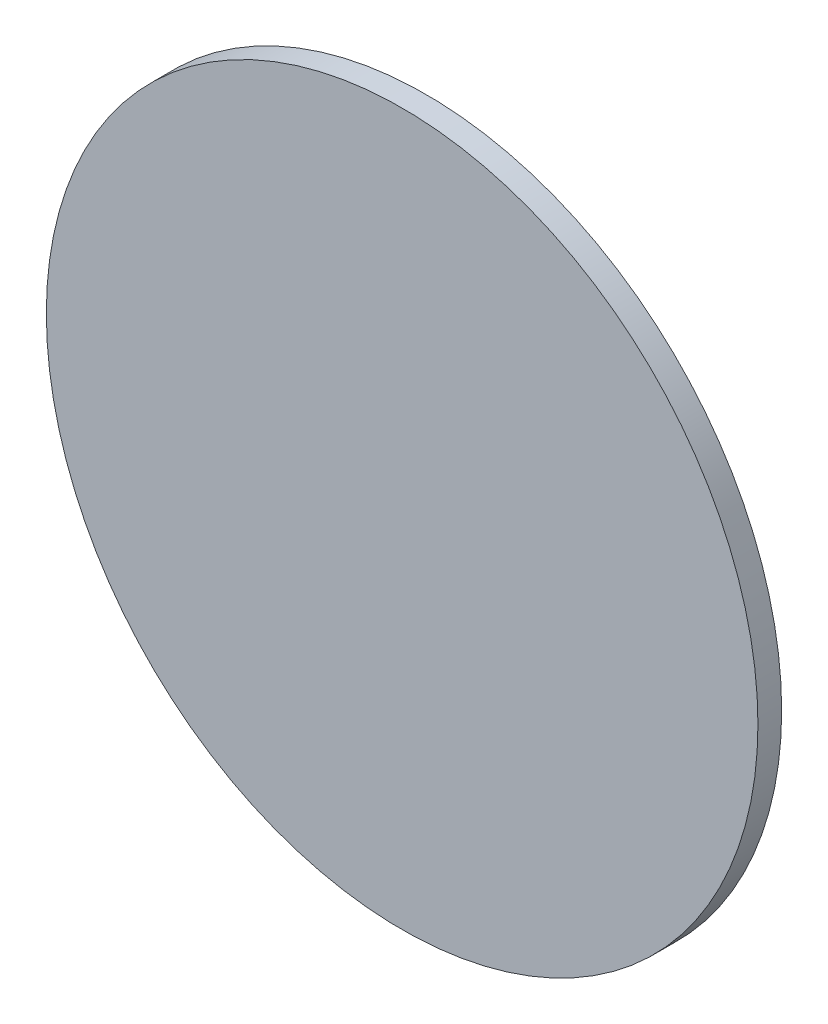
ISO-10303-21;
HEADER;
FILE_DESCRIPTION(('STEP AP214'),'2;1');
FILE_NAME('part.step','',(''),(''),'','','');
FILE_SCHEMA(('AUTOMOTIVE_DESIGN { 1 0 10303 214 1 1 1 1 }'));
ENDSEC;
DATA;
#1=APPLICATION_CONTEXT('core data for automotive mechanical design processes');
#2=APPLICATION_PROTOCOL_DEFINITION('international standard','automotive_design',2000,#1);
#3=PRODUCT_CONTEXT('',#1,'mechanical');
#4=PRODUCT('Part','Part','',(#3));
#5=PRODUCT_RELATED_PRODUCT_CATEGORY('part','',(#4));
#6=PRODUCT_DEFINITION_FORMATION('','',#4);
#7=PRODUCT_DEFINITION_CONTEXT('part definition',#1,'design');
#8=PRODUCT_DEFINITION('design','',#6,#7);
#9=PRODUCT_DEFINITION_SHAPE('','',#8);
#10=(LENGTH_UNIT() NAMED_UNIT(*) SI_UNIT(.MILLI.,.METRE.));
#11=(NAMED_UNIT(*) PLANE_ANGLE_UNIT() SI_UNIT($,.RADIAN.));
#12=(NAMED_UNIT(*) SI_UNIT($,.STERADIAN.) SOLID_ANGLE_UNIT());
#13=UNCERTAINTY_MEASURE_WITH_UNIT(LENGTH_MEASURE(1.E-05),#10,'distance_accuracy_value','');
#14=(GEOMETRIC_REPRESENTATION_CONTEXT(3) GLOBAL_UNCERTAINTY_ASSIGNED_CONTEXT((#13)) GLOBAL_UNIT_ASSIGNED_CONTEXT((#10,
#11,#12)) REPRESENTATION_CONTEXT('',''));
#15=CARTESIAN_POINT('',(0.,0.,0.));
#16=DIRECTION('',(0.,0.,1.));
#17=DIRECTION('',(1.,0.,0.));
#18=AXIS2_PLACEMENT_3D('',#15,#16,#17);
#19=CARTESIAN_POINT('',(0.,0.,2.54));
#20=DIRECTION('',(0.,0.,-1.));
#21=DIRECTION('',(-1.,0.,0.));
#22=AXIS2_PLACEMENT_3D('',#19,#20,#21);
#23=CYLINDRICAL_SURFACE('',#22,38.1);
#24=CARTESIAN_POINT('',(0.,0.,2.54));
#25=DIRECTION('',(0.,0.,1.));
#26=DIRECTION('',(1.,0.,0.));
#27=AXIS2_PLACEMENT_3D('',#24,#25,#26);
#28=CIRCLE('',#27,38.1);
#29=CARTESIAN_POINT('',(38.1,0.,2.54));
#30=VERTEX_POINT('',#29);
#31=EDGE_CURVE('E10',#30,#30,#28,.T.);
#32=ORIENTED_EDGE('',*,*,#31,.F.);
#33=EDGE_LOOP('',(#32));
#34=FACE_BOUND('',#33,.T.);
#35=CARTESIAN_POINT('',(0.,0.,0.));
#36=DIRECTION('',(0.,0.,1.));
#37=DIRECTION('',(1.,0.,0.));
#38=AXIS2_PLACEMENT_3D('',#35,#36,#37);
#39=CIRCLE('',#38,38.1);
#40=CARTESIAN_POINT('',(38.1,0.,0.));
#41=VERTEX_POINT('',#40);
#42=EDGE_CURVE('E33',#41,#41,#39,.T.);
#43=ORIENTED_EDGE('',*,*,#42,.T.);
#44=EDGE_LOOP('',(#43));
#45=FACE_BOUND('',#44,.T.);
#46=ADVANCED_FACE('F30',(#34,#45),#23,.T.);
#47=CARTESIAN_POINT('',(0.,0.,2.54));
#48=DIRECTION('',(0.,0.,1.));
#49=DIRECTION('',(1.,0.,0.));
#50=AXIS2_PLACEMENT_3D('',#47,#48,#49);
#51=PLANE('',#50);
#52=ORIENTED_EDGE('',*,*,#31,.T.);
#53=EDGE_LOOP('',(#52));
#54=FACE_BOUND('',#53,.T.);
#55=ADVANCED_FACE('F45',(#54),#51,.T.);
#56=CARTESIAN_POINT('',(0.,0.,0.));
#57=DIRECTION('',(0.,0.,1.));
#58=DIRECTION('',(1.,0.,0.));
#59=AXIS2_PLACEMENT_3D('',#56,#57,#58);
#60=PLANE('',#59);
#61=ORIENTED_EDGE('',*,*,#42,.F.);
#62=EDGE_LOOP('',(#61));
#63=FACE_BOUND('',#62,.T.);
#64=ADVANCED_FACE('F43',(#63),#60,.F.);
#65=CLOSED_SHELL('',(#46,#55,#64));
#66=MANIFOLD_SOLID_BREP('B2',#65);
#67=ADVANCED_BREP_SHAPE_REPRESENTATION('',(#18,#66),#14);
#68=SHAPE_DEFINITION_REPRESENTATION(#9,#67);
ENDSEC;
END-ISO-10303-21;
